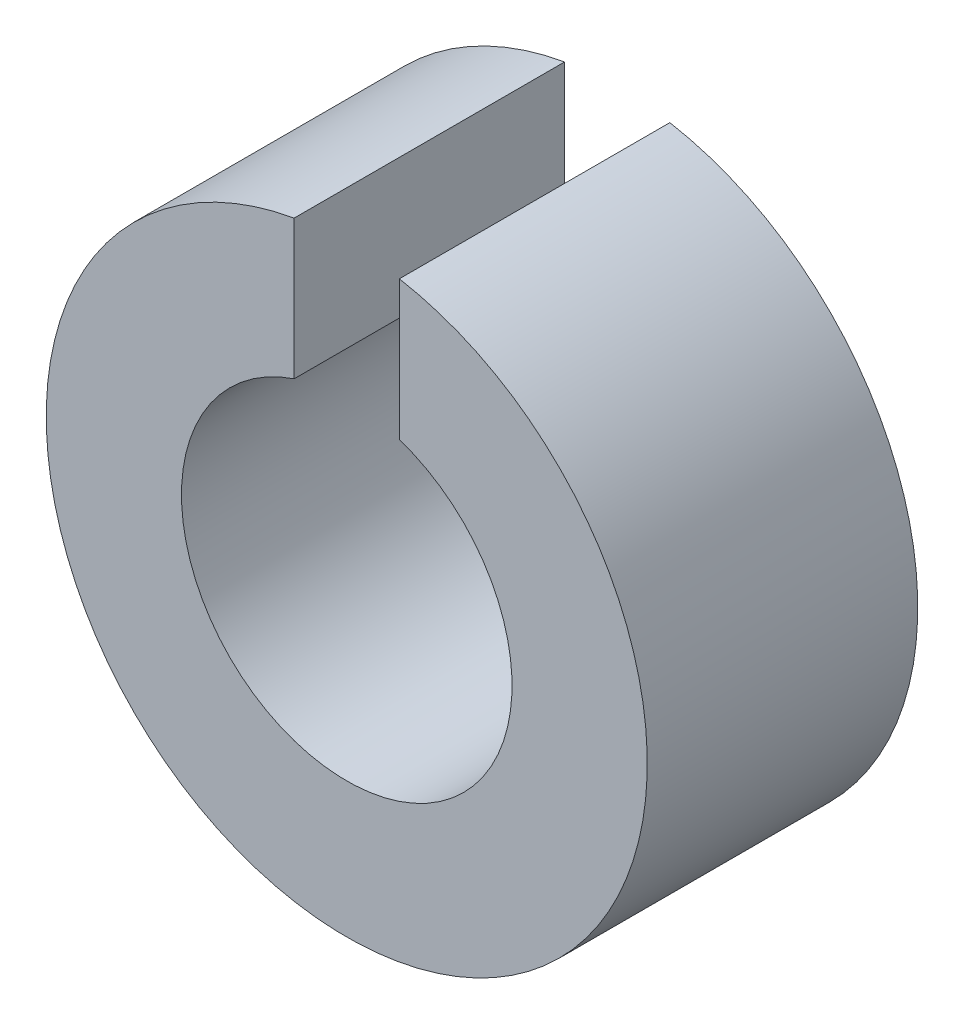
ISO-10303-21;
HEADER;
FILE_DESCRIPTION(('STEP AP214'),'2;1');
FILE_NAME('part.step','',(''),(''),'','','');
FILE_SCHEMA(('AUTOMOTIVE_DESIGN { 1 0 10303 214 1 1 1 1 }'));
ENDSEC;
DATA;
#1=APPLICATION_CONTEXT('core data for automotive mechanical design processes');
#2=APPLICATION_PROTOCOL_DEFINITION('international standard','automotive_design',2000,#1);
#3=PRODUCT_CONTEXT('',#1,'mechanical');
#4=PRODUCT('Part','Part','',(#3));
#5=PRODUCT_RELATED_PRODUCT_CATEGORY('part','',(#4));
#6=PRODUCT_DEFINITION_FORMATION('','',#4);
#7=PRODUCT_DEFINITION_CONTEXT('part definition',#1,'design');
#8=PRODUCT_DEFINITION('design','',#6,#7);
#9=PRODUCT_DEFINITION_SHAPE('','',#8);
#10=(LENGTH_UNIT() NAMED_UNIT(*) SI_UNIT(.MILLI.,.METRE.));
#11=(NAMED_UNIT(*) PLANE_ANGLE_UNIT() SI_UNIT($,.RADIAN.));
#12=(NAMED_UNIT(*) SI_UNIT($,.STERADIAN.) SOLID_ANGLE_UNIT());
#13=UNCERTAINTY_MEASURE_WITH_UNIT(LENGTH_MEASURE(1.E-05),#10,'distance_accuracy_value','');
#14=(GEOMETRIC_REPRESENTATION_CONTEXT(3) GLOBAL_UNCERTAINTY_ASSIGNED_CONTEXT((#13)) GLOBAL_UNIT_ASSIGNED_CONTEXT((#10,
#11,#12)) REPRESENTATION_CONTEXT('',''));
#15=CARTESIAN_POINT('',(0.,0.,0.));
#16=DIRECTION('',(0.,0.,1.));
#17=DIRECTION('',(1.,0.,0.));
#18=AXIS2_PLACEMENT_3D('',#15,#16,#17);
#19=CARTESIAN_POINT('',(0.,0.,9.));
#20=DIRECTION('',(0.,0.,1.));
#21=DIRECTION('',(1.00000000000001,0.,0.));
#22=AXIS2_PLACEMENT_3D('',#19,#20,#21);
#23=PLANE('',#22);
#24=DIRECTION('',(0.,1.00000000000001,0.));
#25=VECTOR('',#24,1.);
#26=CARTESIAN_POINT('',(1.75000000000002,17.5000000000002,9.));
#27=LINE('',#26,#25);
#28=CARTESIAN_POINT('',(1.75000000000002,5.21416340365359,9.));
#29=VERTEX_POINT('',#28);
#30=CARTESIAN_POINT('',(1.75000000000002,9.84568433375769,9.));
#31=VERTEX_POINT('',#30);
#32=EDGE_CURVE('E85',#29,#31,#27,.T.);
#33=ORIENTED_EDGE('',*,*,#32,.F.);
#34=CARTESIAN_POINT('',(0.,0.,9.));
#35=DIRECTION('',(0.,0.,1.));
#36=DIRECTION('',(1.00000000000001,0.,0.));
#37=AXIS2_PLACEMENT_3D('',#34,#35,#36);
#38=CIRCLE('',#37,5.5);
#39=CARTESIAN_POINT('',(-1.75000000000002,5.21416340365359,9.));
#40=VERTEX_POINT('',#39);
#41=EDGE_CURVE('E94',#40,#29,#38,.T.);
#42=ORIENTED_EDGE('',*,*,#41,.F.);
#43=DIRECTION('',(0.,-1.00000000000001,0.));
#44=VECTOR('',#43,1.);
#45=CARTESIAN_POINT('',(-1.75000000000002,17.5000000000002,9.));
#46=LINE('',#45,#44);
#47=CARTESIAN_POINT('',(-1.75000000000002,9.84568433375769,9.));
#48=VERTEX_POINT('',#47);
#49=EDGE_CURVE('E68',#48,#40,#46,.T.);
#50=ORIENTED_EDGE('',*,*,#49,.F.);
#51=CARTESIAN_POINT('',(0.,0.,9.));
#52=DIRECTION('',(0.,0.,1.));
#53=DIRECTION('',(1.00000000000001,0.,0.));
#54=AXIS2_PLACEMENT_3D('',#51,#52,#53);
#55=CIRCLE('',#54,10.);
#56=EDGE_CURVE('E96',#48,#31,#55,.T.);
#57=ORIENTED_EDGE('',*,*,#56,.T.);
#58=EDGE_LOOP('',(#33,#42,#50,#57));
#59=FACE_BOUND('',#58,.T.);
#60=ADVANCED_FACE('F46',(#59),#23,.T.);
#61=CARTESIAN_POINT('',(0.,0.,0.));
#62=DIRECTION('',(0.,0.,1.));
#63=DIRECTION('',(1.00000000000001,0.,0.));
#64=AXIS2_PLACEMENT_3D('',#61,#62,#63);
#65=PLANE('',#64);
#66=CARTESIAN_POINT('',(0.,0.,0.));
#67=DIRECTION('',(0.,0.,1.));
#68=DIRECTION('',(1.00000000000001,0.,0.));
#69=AXIS2_PLACEMENT_3D('',#66,#67,#68);
#70=CIRCLE('',#69,5.5);
#71=CARTESIAN_POINT('',(-1.75000000000002,5.21416340365359,0.));
#72=VERTEX_POINT('',#71);
#73=CARTESIAN_POINT('',(1.75000000000002,5.21416340365359,0.));
#74=VERTEX_POINT('',#73);
#75=EDGE_CURVE('E100',#72,#74,#70,.T.);
#76=ORIENTED_EDGE('',*,*,#75,.T.);
#77=DIRECTION('',(0.,1.00000000000001,0.));
#78=VECTOR('',#77,1.);
#79=CARTESIAN_POINT('',(1.75000000000002,17.5000000000002,0.));
#80=LINE('',#79,#78);
#81=CARTESIAN_POINT('',(1.75000000000002,9.84568433375769,0.));
#82=VERTEX_POINT('',#81);
#83=EDGE_CURVE('E60',#74,#82,#80,.T.);
#84=ORIENTED_EDGE('',*,*,#83,.T.);
#85=CARTESIAN_POINT('',(0.,0.,0.));
#86=DIRECTION('',(0.,0.,1.));
#87=DIRECTION('',(1.00000000000001,0.,0.));
#88=AXIS2_PLACEMENT_3D('',#85,#86,#87);
#89=CIRCLE('',#88,10.);
#90=CARTESIAN_POINT('',(-1.75000000000002,9.84568433375769,0.));
#91=VERTEX_POINT('',#90);
#92=EDGE_CURVE('E99',#91,#82,#89,.T.);
#93=ORIENTED_EDGE('',*,*,#92,.F.);
#94=DIRECTION('',(0.,-1.00000000000001,0.));
#95=VECTOR('',#94,1.);
#96=CARTESIAN_POINT('',(-1.75000000000002,17.5000000000002,0.));
#97=LINE('',#96,#95);
#98=EDGE_CURVE('E111',#91,#72,#97,.T.);
#99=ORIENTED_EDGE('',*,*,#98,.T.);
#100=EDGE_LOOP('',(#76,#84,#93,#99));
#101=FACE_BOUND('',#100,.T.);
#102=ADVANCED_FACE('F115',(#101),#65,.F.);
#103=CARTESIAN_POINT('',(0.,0.,9.));
#104=DIRECTION('',(0.,0.,-1.));
#105=DIRECTION('',(-1.00000000000001,0.,0.));
#106=AXIS2_PLACEMENT_3D('',#103,#104,#105);
#107=CYLINDRICAL_SURFACE('',#106,10.);
#108=ORIENTED_EDGE('',*,*,#92,.T.);
#109=DIRECTION('',(0.,0.,-1.));
#110=VECTOR('',#109,1.);
#111=CARTESIAN_POINT('',(1.75000000000002,9.84568433375769,9.));
#112=LINE('',#111,#110);
#113=EDGE_CURVE('E104',#82,#31,#112,.F.);
#114=ORIENTED_EDGE('',*,*,#113,.T.);
#115=ORIENTED_EDGE('',*,*,#56,.F.);
#116=DIRECTION('',(0.,0.,-1.));
#117=VECTOR('',#116,1.);
#118=CARTESIAN_POINT('',(-1.75000000000002,9.84568433375769,9.));
#119=LINE('',#118,#117);
#120=EDGE_CURVE('E116',#48,#91,#119,.T.);
#121=ORIENTED_EDGE('',*,*,#120,.T.);
#122=EDGE_LOOP('',(#108,#114,#115,#121));
#123=FACE_BOUND('',#122,.T.);
#124=ADVANCED_FACE('F48',(#123),#107,.T.);
#125=CARTESIAN_POINT('',(0.,0.,9.));
#126=DIRECTION('',(0.,0.,-1.));
#127=DIRECTION('',(-1.00000000000001,0.,0.));
#128=AXIS2_PLACEMENT_3D('',#125,#126,#127);
#129=CYLINDRICAL_SURFACE('',#128,5.5);
#130=DIRECTION('',(0.,0.,-1.));
#131=VECTOR('',#130,1.);
#132=CARTESIAN_POINT('',(1.75000000000002,5.21416340365359,9.));
#133=LINE('',#132,#131);
#134=EDGE_CURVE('E13',#74,#29,#133,.F.);
#135=ORIENTED_EDGE('',*,*,#134,.F.);
#136=ORIENTED_EDGE('',*,*,#75,.F.);
#137=DIRECTION('',(0.,0.,-1.));
#138=VECTOR('',#137,1.);
#139=CARTESIAN_POINT('',(-1.75000000000002,5.21416340365359,9.));
#140=LINE('',#139,#138);
#141=EDGE_CURVE('E54',#40,#72,#140,.T.);
#142=ORIENTED_EDGE('',*,*,#141,.F.);
#143=ORIENTED_EDGE('',*,*,#41,.T.);
#144=EDGE_LOOP('',(#135,#136,#142,#143));
#145=FACE_BOUND('',#144,.T.);
#146=ADVANCED_FACE('F98',(#145),#129,.F.);
#147=CARTESIAN_POINT('',(-1.75000000000002,17.5000000000002,0.));
#148=DIRECTION('',(-1.00000000000001,0.,0.));
#149=DIRECTION('',(0.,-1.00000000000001,0.));
#150=AXIS2_PLACEMENT_3D('',#147,#148,#149);
#151=PLANE('',#150);
#152=ORIENTED_EDGE('',*,*,#49,.T.);
#153=ORIENTED_EDGE('',*,*,#141,.T.);
#154=ORIENTED_EDGE('',*,*,#98,.F.);
#155=ORIENTED_EDGE('',*,*,#120,.F.);
#156=EDGE_LOOP('',(#152,#153,#154,#155));
#157=FACE_BOUND('',#156,.T.);
#158=ADVANCED_FACE('F110',(#157),#151,.F.);
#159=CARTESIAN_POINT('',(1.75000000000002,17.5000000000002,0.));
#160=DIRECTION('',(1.00000000000001,0.,0.));
#161=DIRECTION('',(0.,1.00000000000001,0.));
#162=AXIS2_PLACEMENT_3D('',#159,#160,#161);
#163=PLANE('',#162);
#164=ORIENTED_EDGE('',*,*,#83,.F.);
#165=ORIENTED_EDGE('',*,*,#134,.T.);
#166=ORIENTED_EDGE('',*,*,#32,.T.);
#167=ORIENTED_EDGE('',*,*,#113,.F.);
#168=EDGE_LOOP('',(#164,#165,#166,#167));
#169=FACE_BOUND('',#168,.T.);
#170=ADVANCED_FACE('F84',(#169),#163,.F.);
#171=CLOSED_SHELL('',(#60,#102,#124,#146,#158,#170));
#172=MANIFOLD_SOLID_BREP('B2',#171);
#173=ADVANCED_BREP_SHAPE_REPRESENTATION('',(#18,#172),#14);
#174=SHAPE_DEFINITION_REPRESENTATION(#9,#173);
ENDSEC;
END-ISO-10303-21;
